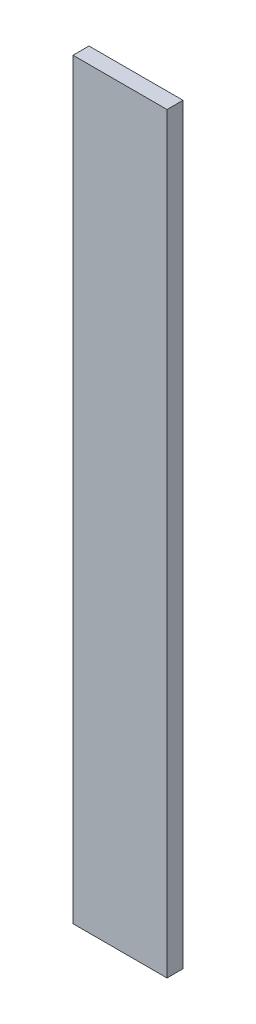
ISO-10303-21;
HEADER;
FILE_DESCRIPTION(('STEP AP214'),'2;1');
FILE_NAME('part.step','',(''),(''),'','','');
FILE_SCHEMA(('AUTOMOTIVE_DESIGN { 1 0 10303 214 1 1 1 1 }'));
ENDSEC;
DATA;
#1=APPLICATION_CONTEXT('core data for automotive mechanical design processes');
#2=APPLICATION_PROTOCOL_DEFINITION('international standard','automotive_design',2000,#1);
#3=PRODUCT_CONTEXT('',#1,'mechanical');
#4=PRODUCT('Part','Part','',(#3));
#5=PRODUCT_RELATED_PRODUCT_CATEGORY('part','',(#4));
#6=PRODUCT_DEFINITION_FORMATION('','',#4);
#7=PRODUCT_DEFINITION_CONTEXT('part definition',#1,'design');
#8=PRODUCT_DEFINITION('design','',#6,#7);
#9=PRODUCT_DEFINITION_SHAPE('','',#8);
#10=(LENGTH_UNIT() NAMED_UNIT(*) SI_UNIT(.MILLI.,.METRE.));
#11=(NAMED_UNIT(*) PLANE_ANGLE_UNIT() SI_UNIT($,.RADIAN.));
#12=(NAMED_UNIT(*) SI_UNIT($,.STERADIAN.) SOLID_ANGLE_UNIT());
#13=UNCERTAINTY_MEASURE_WITH_UNIT(LENGTH_MEASURE(1.E-05),#10,'distance_accuracy_value','');
#14=(GEOMETRIC_REPRESENTATION_CONTEXT(3) GLOBAL_UNCERTAINTY_ASSIGNED_CONTEXT((#13)) GLOBAL_UNIT_ASSIGNED_CONTEXT((#10,
#11,#12)) REPRESENTATION_CONTEXT('',''));
#15=CARTESIAN_POINT('',(0.,0.,0.));
#16=DIRECTION('',(0.,0.,1.));
#17=DIRECTION('',(1.,0.,0.));
#18=AXIS2_PLACEMENT_3D('',#15,#16,#17);
#19=CARTESIAN_POINT('',(-1.27,10.16,0.4318));
#20=DIRECTION('',(0.,0.,1.));
#21=DIRECTION('',(1.,0.,0.));
#22=AXIS2_PLACEMENT_3D('',#19,#20,#21);
#23=PLANE('',#22);
#24=DIRECTION('',(0.,1.,0.));
#25=VECTOR('',#24,1.);
#26=CARTESIAN_POINT('',(1.27,10.16,0.4318));
#27=LINE('',#26,#25);
#28=CARTESIAN_POINT('',(1.27,10.16,0.4318));
#29=VERTEX_POINT('',#28);
#30=CARTESIAN_POINT('',(1.27,-10.16,0.4318));
#31=VERTEX_POINT('',#30);
#32=EDGE_CURVE('E52',#29,#31,#27,.F.);
#33=ORIENTED_EDGE('',*,*,#32,.F.);
#34=DIRECTION('',(1.,0.,0.));
#35=VECTOR('',#34,1.);
#36=CARTESIAN_POINT('',(-1.27,10.16,0.4318));
#37=LINE('',#36,#35);
#38=CARTESIAN_POINT('',(-1.27,10.16,0.4318));
#39=VERTEX_POINT('',#38);
#40=EDGE_CURVE('E67',#39,#29,#37,.T.);
#41=ORIENTED_EDGE('',*,*,#40,.F.);
#42=DIRECTION('',(0.,1.,0.));
#43=VECTOR('',#42,1.);
#44=CARTESIAN_POINT('',(-1.27,-10.16,0.4318));
#45=LINE('',#44,#43);
#46=CARTESIAN_POINT('',(-1.27,-10.16,0.4318));
#47=VERTEX_POINT('',#46);
#48=EDGE_CURVE('E19',#47,#39,#45,.T.);
#49=ORIENTED_EDGE('',*,*,#48,.F.);
#50=DIRECTION('',(1.,0.,0.));
#51=VECTOR('',#50,1.);
#52=CARTESIAN_POINT('',(1.27,-10.16,0.4318));
#53=LINE('',#52,#51);
#54=EDGE_CURVE('E57',#31,#47,#53,.F.);
#55=ORIENTED_EDGE('',*,*,#54,.F.);
#56=EDGE_LOOP('',(#33,#41,#49,#55));
#57=FACE_BOUND('',#56,.T.);
#58=ADVANCED_FACE('F16',(#57),#23,.T.);
#59=CARTESIAN_POINT('',(-1.27,-10.16,0.));
#60=DIRECTION('',(-1.,0.,0.));
#61=DIRECTION('',(0.,0.,1.));
#62=AXIS2_PLACEMENT_3D('',#59,#60,#61);
#63=PLANE('',#62);
#64=DIRECTION('',(0.,0.,1.));
#65=VECTOR('',#64,1.);
#66=CARTESIAN_POINT('',(-1.27,10.16,0.));
#67=LINE('',#66,#65);
#68=CARTESIAN_POINT('',(-1.27,10.16,0.));
#69=VERTEX_POINT('',#68);
#70=EDGE_CURVE('E78',#69,#39,#67,.T.);
#71=ORIENTED_EDGE('',*,*,#70,.F.);
#72=DIRECTION('',(0.,1.,0.));
#73=VECTOR('',#72,1.);
#74=CARTESIAN_POINT('',(-1.27,10.16,0.));
#75=LINE('',#74,#73);
#76=CARTESIAN_POINT('',(-1.27,-10.16,0.));
#77=VERTEX_POINT('',#76);
#78=EDGE_CURVE('E73',#69,#77,#75,.F.);
#79=ORIENTED_EDGE('',*,*,#78,.T.);
#80=DIRECTION('',(0.,0.,-1.));
#81=VECTOR('',#80,1.);
#82=CARTESIAN_POINT('',(-1.27,-10.16,0.));
#83=LINE('',#82,#81);
#84=EDGE_CURVE('E62',#47,#77,#83,.T.);
#85=ORIENTED_EDGE('',*,*,#84,.F.);
#86=ORIENTED_EDGE('',*,*,#48,.T.);
#87=EDGE_LOOP('',(#71,#79,#85,#86));
#88=FACE_BOUND('',#87,.T.);
#89=ADVANCED_FACE('F72',(#88),#63,.T.);
#90=CARTESIAN_POINT('',(1.27,-10.16,0.));
#91=DIRECTION('',(0.,-1.,0.));
#92=DIRECTION('',(0.,0.,-1.));
#93=AXIS2_PLACEMENT_3D('',#90,#91,#92);
#94=PLANE('',#93);
#95=ORIENTED_EDGE('',*,*,#84,.T.);
#96=DIRECTION('',(1.,0.,0.));
#97=VECTOR('',#96,1.);
#98=CARTESIAN_POINT('',(-1.27,-10.16,0.));
#99=LINE('',#98,#97);
#100=CARTESIAN_POINT('',(1.27,-10.16,0.));
#101=VERTEX_POINT('',#100);
#102=EDGE_CURVE('E83',#77,#101,#99,.T.);
#103=ORIENTED_EDGE('',*,*,#102,.T.);
#104=DIRECTION('',(0.,0.,-1.));
#105=VECTOR('',#104,1.);
#106=CARTESIAN_POINT('',(1.27,-10.16,0.));
#107=LINE('',#106,#105);
#108=EDGE_CURVE('E64',#31,#101,#107,.T.);
#109=ORIENTED_EDGE('',*,*,#108,.F.);
#110=ORIENTED_EDGE('',*,*,#54,.T.);
#111=EDGE_LOOP('',(#95,#103,#109,#110));
#112=FACE_BOUND('',#111,.T.);
#113=ADVANCED_FACE('F59',(#112),#94,.T.);
#114=CARTESIAN_POINT('',(1.27,10.16,0.));
#115=DIRECTION('',(1.,0.,0.));
#116=DIRECTION('',(0.,0.,-1.));
#117=AXIS2_PLACEMENT_3D('',#114,#115,#116);
#118=PLANE('',#117);
#119=ORIENTED_EDGE('',*,*,#108,.T.);
#120=DIRECTION('',(0.,1.,0.));
#121=VECTOR('',#120,1.);
#122=CARTESIAN_POINT('',(1.27,10.16,0.));
#123=LINE('',#122,#121);
#124=CARTESIAN_POINT('',(1.27,10.16,0.));
#125=VERTEX_POINT('',#124);
#126=EDGE_CURVE('E25',#101,#125,#123,.T.);
#127=ORIENTED_EDGE('',*,*,#126,.T.);
#128=DIRECTION('',(0.,0.,1.));
#129=VECTOR('',#128,1.);
#130=CARTESIAN_POINT('',(1.27,10.16,0.));
#131=LINE('',#130,#129);
#132=EDGE_CURVE('E33',#29,#125,#131,.F.);
#133=ORIENTED_EDGE('',*,*,#132,.F.);
#134=ORIENTED_EDGE('',*,*,#32,.T.);
#135=EDGE_LOOP('',(#119,#127,#133,#134));
#136=FACE_BOUND('',#135,.T.);
#137=ADVANCED_FACE('F87',(#136),#118,.T.);
#138=CARTESIAN_POINT('',(-1.27,10.16,0.));
#139=DIRECTION('',(0.,1.,0.));
#140=DIRECTION('',(0.,0.,1.));
#141=AXIS2_PLACEMENT_3D('',#138,#139,#140);
#142=PLANE('',#141);
#143=ORIENTED_EDGE('',*,*,#132,.T.);
#144=DIRECTION('',(1.,0.,0.));
#145=VECTOR('',#144,1.);
#146=CARTESIAN_POINT('',(-1.27,10.16,0.));
#147=LINE('',#146,#145);
#148=EDGE_CURVE('E11',#125,#69,#147,.F.);
#149=ORIENTED_EDGE('',*,*,#148,.T.);
#150=ORIENTED_EDGE('',*,*,#70,.T.);
#151=ORIENTED_EDGE('',*,*,#40,.T.);
#152=EDGE_LOOP('',(#143,#149,#150,#151));
#153=FACE_BOUND('',#152,.T.);
#154=ADVANCED_FACE('F90',(#153),#142,.T.);
#155=CARTESIAN_POINT('',(-1.27,10.16,0.));
#156=DIRECTION('',(0.,0.,1.));
#157=DIRECTION('',(1.,0.,0.));
#158=AXIS2_PLACEMENT_3D('',#155,#156,#157);
#159=PLANE('',#158);
#160=ORIENTED_EDGE('',*,*,#126,.F.);
#161=ORIENTED_EDGE('',*,*,#102,.F.);
#162=ORIENTED_EDGE('',*,*,#78,.F.);
#163=ORIENTED_EDGE('',*,*,#148,.F.);
#164=EDGE_LOOP('',(#160,#161,#162,#163));
#165=FACE_BOUND('',#164,.T.);
#166=ADVANCED_FACE('F89',(#165),#159,.F.);
#167=CLOSED_SHELL('',(#58,#89,#113,#137,#154,#166));
#168=MANIFOLD_SOLID_BREP('B1',#167);
#169=ADVANCED_BREP_SHAPE_REPRESENTATION('',(#18,#168),#14);
#170=SHAPE_DEFINITION_REPRESENTATION(#9,#169);
ENDSEC;
END-ISO-10303-21;
